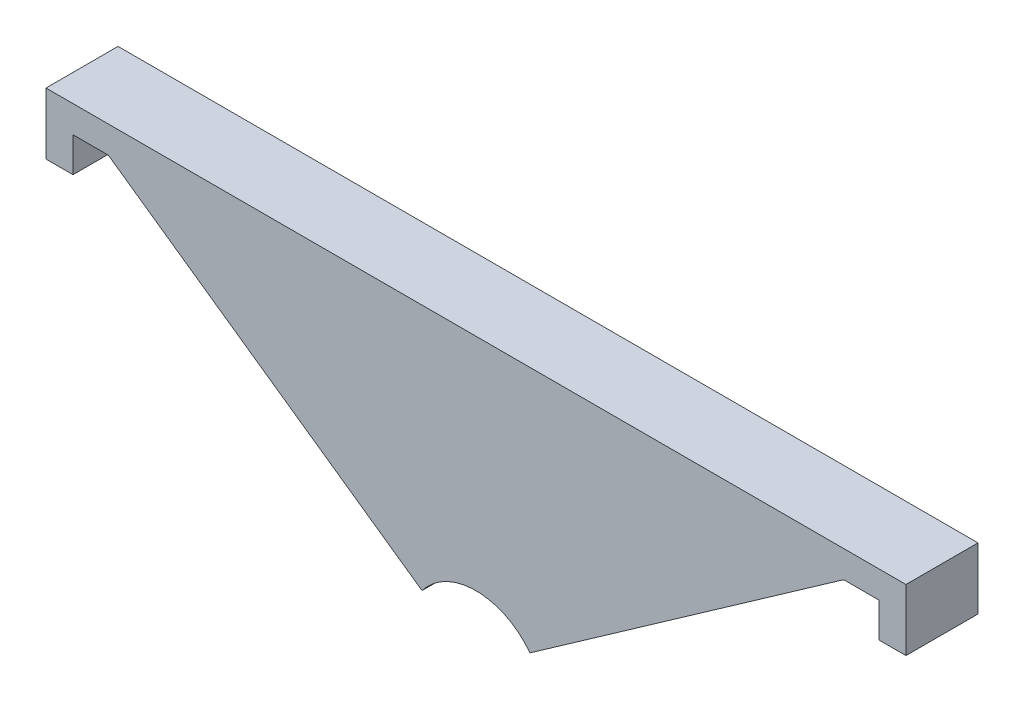
ISO-10303-21;
HEADER;
FILE_DESCRIPTION(('STEP AP214'),'2;1');
FILE_NAME('part.step','',(''),(''),'','','');
FILE_SCHEMA(('AUTOMOTIVE_DESIGN { 1 0 10303 214 1 1 1 1 }'));
ENDSEC;
DATA;
#1=APPLICATION_CONTEXT('core data for automotive mechanical design processes');
#2=APPLICATION_PROTOCOL_DEFINITION('international standard','automotive_design',2000,#1);
#3=PRODUCT_CONTEXT('',#1,'mechanical');
#4=PRODUCT('Part','Part','',(#3));
#5=PRODUCT_RELATED_PRODUCT_CATEGORY('part','',(#4));
#6=PRODUCT_DEFINITION_FORMATION('','',#4);
#7=PRODUCT_DEFINITION_CONTEXT('part definition',#1,'design');
#8=PRODUCT_DEFINITION('design','',#6,#7);
#9=PRODUCT_DEFINITION_SHAPE('','',#8);
#10=(LENGTH_UNIT() NAMED_UNIT(*) SI_UNIT(.MILLI.,.METRE.));
#11=(NAMED_UNIT(*) PLANE_ANGLE_UNIT() SI_UNIT($,.RADIAN.));
#12=(NAMED_UNIT(*) SI_UNIT($,.STERADIAN.) SOLID_ANGLE_UNIT());
#13=UNCERTAINTY_MEASURE_WITH_UNIT(LENGTH_MEASURE(1.E-05),#10,'distance_accuracy_value','');
#14=(GEOMETRIC_REPRESENTATION_CONTEXT(3) GLOBAL_UNCERTAINTY_ASSIGNED_CONTEXT((#13)) GLOBAL_UNIT_ASSIGNED_CONTEXT((#10,
#11,#12)) REPRESENTATION_CONTEXT('',''));
#15=CARTESIAN_POINT('',(0.,0.,0.));
#16=DIRECTION('',(0.,0.,1.));
#17=DIRECTION('',(1.,0.,0.));
#18=AXIS2_PLACEMENT_3D('',#15,#16,#17);
#19=CARTESIAN_POINT('',(-47.75,65.6296073544931,8.));
#20=DIRECTION('',(1.,0.,0.));
#21=DIRECTION('',(0.,0.,-1.));
#22=AXIS2_PLACEMENT_3D('',#19,#20,#21);
#23=PLANE('',#22);
#24=DIRECTION('',(0.,-1.,0.));
#25=VECTOR('',#24,1.);
#26=CARTESIAN_POINT('',(-47.75,65.6296073544931,0.));
#27=LINE('',#26,#25);
#28=CARTESIAN_POINT('',(-47.75,72.4689283735536,0.));
#29=VERTEX_POINT('',#28);
#30=CARTESIAN_POINT('',(-47.75,65.6296073544931,0.));
#31=VERTEX_POINT('',#30);
#32=EDGE_CURVE('E155',#29,#31,#27,.T.);
#33=ORIENTED_EDGE('',*,*,#32,.T.);
#34=DIRECTION('',(0.,0.,-1.));
#35=VECTOR('',#34,1.);
#36=CARTESIAN_POINT('',(-47.75,65.6296073544931,8.));
#37=LINE('',#36,#35);
#38=CARTESIAN_POINT('',(-47.75,65.6296073544931,8.));
#39=VERTEX_POINT('',#38);
#40=EDGE_CURVE('E11',#39,#31,#37,.T.);
#41=ORIENTED_EDGE('',*,*,#40,.F.);
#42=DIRECTION('',(0.,-1.,0.));
#43=VECTOR('',#42,1.);
#44=CARTESIAN_POINT('',(-47.75,65.6296073544931,8.));
#45=LINE('',#44,#43);
#46=CARTESIAN_POINT('',(-47.75,72.4689283735536,8.));
#47=VERTEX_POINT('',#46);
#48=EDGE_CURVE('E177',#47,#39,#45,.T.);
#49=ORIENTED_EDGE('',*,*,#48,.F.);
#50=DIRECTION('',(0.,0.,-1.));
#51=VECTOR('',#50,1.);
#52=CARTESIAN_POINT('',(-47.75,72.4689283735536,8.));
#53=LINE('',#52,#51);
#54=EDGE_CURVE('E151',#47,#29,#53,.T.);
#55=ORIENTED_EDGE('',*,*,#54,.T.);
#56=EDGE_LOOP('',(#33,#41,#49,#55));
#57=FACE_BOUND('',#56,.T.);
#58=ADVANCED_FACE('F35',(#57),#23,.F.);
#59=CARTESIAN_POINT('',(-47.75,65.6296073544931,8.));
#60=DIRECTION('',(0.,1.,0.));
#61=DIRECTION('',(0.,0.,1.));
#62=AXIS2_PLACEMENT_3D('',#59,#60,#61);
#63=PLANE('',#62);
#64=DIRECTION('',(1.,0.,0.));
#65=VECTOR('',#64,1.);
#66=CARTESIAN_POINT('',(-47.75,65.6296073544931,0.));
#67=LINE('',#66,#65);
#68=CARTESIAN_POINT('',(-44.75,65.6296073544931,0.));
#69=VERTEX_POINT('',#68);
#70=EDGE_CURVE('E158',#31,#69,#67,.T.);
#71=ORIENTED_EDGE('',*,*,#70,.T.);
#72=DIRECTION('',(0.,0.,-1.));
#73=VECTOR('',#72,1.);
#74=CARTESIAN_POINT('',(-44.75,65.6296073544931,8.));
#75=LINE('',#74,#73);
#76=CARTESIAN_POINT('',(-44.75,65.6296073544931,8.));
#77=VERTEX_POINT('',#76);
#78=EDGE_CURVE('E43',#77,#69,#75,.T.);
#79=ORIENTED_EDGE('',*,*,#78,.F.);
#80=DIRECTION('',(1.,0.,0.));
#81=VECTOR('',#80,1.);
#82=CARTESIAN_POINT('',(-47.75,65.6296073544931,8.));
#83=LINE('',#82,#81);
#84=EDGE_CURVE('E106',#39,#77,#83,.T.);
#85=ORIENTED_EDGE('',*,*,#84,.F.);
#86=ORIENTED_EDGE('',*,*,#40,.T.);
#87=EDGE_LOOP('',(#71,#79,#85,#86));
#88=FACE_BOUND('',#87,.T.);
#89=ADVANCED_FACE('F255',(#88),#63,.F.);
#90=CARTESIAN_POINT('',(-44.75,65.6296073544931,8.));
#91=DIRECTION('',(-1.,0.,0.));
#92=DIRECTION('',(0.,0.,1.));
#93=AXIS2_PLACEMENT_3D('',#90,#91,#92);
#94=PLANE('',#93);
#95=DIRECTION('',(0.,1.,0.));
#96=VECTOR('',#95,1.);
#97=CARTESIAN_POINT('',(-44.75,65.6296073544931,0.));
#98=LINE('',#97,#96);
#99=CARTESIAN_POINT('',(-44.75,69.4689283735536,0.));
#100=VERTEX_POINT('',#99);
#101=EDGE_CURVE('E160',#69,#100,#98,.T.);
#102=ORIENTED_EDGE('',*,*,#101,.T.);
#103=DIRECTION('',(0.,0.,-1.));
#104=VECTOR('',#103,1.);
#105=CARTESIAN_POINT('',(-44.75,69.4689283735536,8.));
#106=LINE('',#105,#104);
#107=CARTESIAN_POINT('',(-44.75,69.4689283735536,8.));
#108=VERTEX_POINT('',#107);
#109=EDGE_CURVE('E196',#108,#100,#106,.T.);
#110=ORIENTED_EDGE('',*,*,#109,.F.);
#111=DIRECTION('',(0.,1.,0.));
#112=VECTOR('',#111,1.);
#113=CARTESIAN_POINT('',(-44.75,65.6296073544931,8.));
#114=LINE('',#113,#112);
#115=EDGE_CURVE('E204',#77,#108,#114,.T.);
#116=ORIENTED_EDGE('',*,*,#115,.F.);
#117=ORIENTED_EDGE('',*,*,#78,.T.);
#118=EDGE_LOOP('',(#102,#110,#116,#117));
#119=FACE_BOUND('',#118,.T.);
#120=ADVANCED_FACE('F202',(#119),#94,.F.);
#121=CARTESIAN_POINT('',(-44.75,69.4689283735536,8.));
#122=DIRECTION('',(0.,1.,0.));
#123=DIRECTION('',(0.,0.,1.));
#124=AXIS2_PLACEMENT_3D('',#121,#122,#123);
#125=PLANE('',#124);
#126=DIRECTION('',(1.,0.,0.));
#127=VECTOR('',#126,1.);
#128=CARTESIAN_POINT('',(-44.75,69.4689283735536,0.));
#129=LINE('',#128,#127);
#130=CARTESIAN_POINT('',(-40.8316899293085,69.4689283735536,0.));
#131=VERTEX_POINT('',#130);
#132=EDGE_CURVE('E162',#100,#131,#129,.T.);
#133=ORIENTED_EDGE('',*,*,#132,.T.);
#134=DIRECTION('',(0.,0.,-1.));
#135=VECTOR('',#134,1.);
#136=CARTESIAN_POINT('',(-40.8316899293085,69.4689283735536,8.));
#137=LINE('',#136,#135);
#138=CARTESIAN_POINT('',(-40.8316899293085,69.4689283735536,8.));
#139=VERTEX_POINT('',#138);
#140=EDGE_CURVE('E193',#139,#131,#137,.T.);
#141=ORIENTED_EDGE('',*,*,#140,.F.);
#142=DIRECTION('',(1.,0.,0.));
#143=VECTOR('',#142,1.);
#144=CARTESIAN_POINT('',(-44.75,69.4689283735536,8.));
#145=LINE('',#144,#143);
#146=EDGE_CURVE('E222',#108,#139,#145,.T.);
#147=ORIENTED_EDGE('',*,*,#146,.F.);
#148=ORIENTED_EDGE('',*,*,#109,.T.);
#149=EDGE_LOOP('',(#133,#141,#147,#148));
#150=FACE_BOUND('',#149,.T.);
#151=ADVANCED_FACE('F213',(#150),#125,.F.);
#152=CARTESIAN_POINT('',(-40.8316899293085,69.4689283735536,8.));
#153=DIRECTION('',(0.574555500167891,0.818465623729442,0.));
#154=DIRECTION('',(-0.818465623729442,0.574555500167891,0.));
#155=AXIS2_PLACEMENT_3D('',#152,#153,#154);
#156=PLANE('',#155);
#157=DIRECTION('',(0.818465623729442,-0.574555500167891,0.));
#158=VECTOR('',#157,1.);
#159=CARTESIAN_POINT('',(-40.8316899293085,69.4689283735536,0.));
#160=LINE('',#159,#158);
#161=CARTESIAN_POINT('',(-5.99144208167181,45.0113880105764,0.));
#162=VERTEX_POINT('',#161);
#163=EDGE_CURVE('E164',#131,#162,#160,.T.);
#164=ORIENTED_EDGE('',*,*,#163,.T.);
#165=DIRECTION('',(0.,0.,-1.));
#166=VECTOR('',#165,1.);
#167=CARTESIAN_POINT('',(-5.99144208167181,45.0113880105764,8.));
#168=LINE('',#167,#166);
#169=CARTESIAN_POINT('',(-5.99144208167181,45.0113880105764,8.));
#170=VERTEX_POINT('',#169);
#171=EDGE_CURVE('E190',#170,#162,#168,.T.);
#172=ORIENTED_EDGE('',*,*,#171,.F.);
#173=DIRECTION('',(0.818465623729442,-0.574555500167891,0.));
#174=VECTOR('',#173,1.);
#175=CARTESIAN_POINT('',(-40.8316899293085,69.4689283735536,8.));
#176=LINE('',#175,#174);
#177=EDGE_CURVE('E219',#139,#170,#176,.T.);
#178=ORIENTED_EDGE('',*,*,#177,.F.);
#179=ORIENTED_EDGE('',*,*,#140,.T.);
#180=EDGE_LOOP('',(#164,#172,#178,#179));
#181=FACE_BOUND('',#180,.T.);
#182=ADVANCED_FACE('F217',(#181),#156,.F.);
#183=CARTESIAN_POINT('',(0.,40.5,8.));
#184=DIRECTION('',(0.,0.,-1.));
#185=DIRECTION('',(-1.,0.,0.));
#186=AXIS2_PLACEMENT_3D('',#183,#184,#185);
#187=CYLINDRICAL_SURFACE('',#186,7.5);
#188=CARTESIAN_POINT('',(0.,40.5,0.));
#189=DIRECTION('',(0.,0.,-1.));
#190=DIRECTION('',(1.,0.,0.));
#191=AXIS2_PLACEMENT_3D('',#188,#189,#190);
#192=CIRCLE('',#191,7.5);
#193=CARTESIAN_POINT('',(5.99144208167181,45.0113880105764,0.));
#194=VERTEX_POINT('',#193);
#195=EDGE_CURVE('E166',#162,#194,#192,.T.);
#196=ORIENTED_EDGE('',*,*,#195,.T.);
#197=DIRECTION('',(0.,0.,-1.));
#198=VECTOR('',#197,1.);
#199=CARTESIAN_POINT('',(5.99144208167181,45.0113880105764,8.));
#200=LINE('',#199,#198);
#201=CARTESIAN_POINT('',(5.99144208167181,45.0113880105764,8.));
#202=VERTEX_POINT('',#201);
#203=EDGE_CURVE('E187',#202,#194,#200,.T.);
#204=ORIENTED_EDGE('',*,*,#203,.F.);
#205=CARTESIAN_POINT('',(0.,40.5,8.));
#206=DIRECTION('',(0.,0.,-1.));
#207=DIRECTION('',(1.,0.,0.));
#208=AXIS2_PLACEMENT_3D('',#205,#206,#207);
#209=CIRCLE('',#208,7.5);
#210=EDGE_CURVE('E221',#170,#202,#209,.T.);
#211=ORIENTED_EDGE('',*,*,#210,.F.);
#212=ORIENTED_EDGE('',*,*,#171,.T.);
#213=EDGE_LOOP('',(#196,#204,#211,#212));
#214=FACE_BOUND('',#213,.T.);
#215=ADVANCED_FACE('F268',(#214),#187,.F.);
#216=CARTESIAN_POINT('',(40.8316899293085,69.4689283735536,8.));
#217=DIRECTION('',(-0.574555500167891,0.818465623729442,0.));
#218=DIRECTION('',(-0.818465623729442,-0.574555500167891,0.));
#219=AXIS2_PLACEMENT_3D('',#216,#217,#218);
#220=PLANE('',#219);
#221=DIRECTION('',(0.818465623729442,0.574555500167891,0.));
#222=VECTOR('',#221,1.);
#223=CARTESIAN_POINT('',(40.8316899293085,69.4689283735536,0.));
#224=LINE('',#223,#222);
#225=CARTESIAN_POINT('',(40.8316899293085,69.4689283735536,0.));
#226=VERTEX_POINT('',#225);
#227=EDGE_CURVE('E168',#194,#226,#224,.T.);
#228=ORIENTED_EDGE('',*,*,#227,.T.);
#229=DIRECTION('',(0.,0.,-1.));
#230=VECTOR('',#229,1.);
#231=CARTESIAN_POINT('',(40.8316899293085,69.4689283735536,8.));
#232=LINE('',#231,#230);
#233=CARTESIAN_POINT('',(40.8316899293085,69.4689283735536,8.));
#234=VERTEX_POINT('',#233);
#235=EDGE_CURVE('E184',#234,#226,#232,.T.);
#236=ORIENTED_EDGE('',*,*,#235,.F.);
#237=DIRECTION('',(0.818465623729442,0.574555500167891,0.));
#238=VECTOR('',#237,1.);
#239=CARTESIAN_POINT('',(40.8316899293085,69.4689283735536,8.));
#240=LINE('',#239,#238);
#241=EDGE_CURVE('E224',#202,#234,#240,.T.);
#242=ORIENTED_EDGE('',*,*,#241,.F.);
#243=ORIENTED_EDGE('',*,*,#203,.T.);
#244=EDGE_LOOP('',(#228,#236,#242,#243));
#245=FACE_BOUND('',#244,.T.);
#246=ADVANCED_FACE('F271',(#245),#220,.F.);
#247=CARTESIAN_POINT('',(44.75,69.4689283735536,8.));
#248=DIRECTION('',(0.,1.,0.));
#249=DIRECTION('',(0.,0.,1.));
#250=AXIS2_PLACEMENT_3D('',#247,#248,#249);
#251=PLANE('',#250);
#252=DIRECTION('',(1.,0.,0.));
#253=VECTOR('',#252,1.);
#254=CARTESIAN_POINT('',(44.75,69.4689283735536,0.));
#255=LINE('',#254,#253);
#256=CARTESIAN_POINT('',(44.75,69.4689283735536,0.));
#257=VERTEX_POINT('',#256);
#258=EDGE_CURVE('E170',#226,#257,#255,.T.);
#259=ORIENTED_EDGE('',*,*,#258,.T.);
#260=DIRECTION('',(0.,0.,-1.));
#261=VECTOR('',#260,1.);
#262=CARTESIAN_POINT('',(44.75,69.4689283735536,8.));
#263=LINE('',#262,#261);
#264=CARTESIAN_POINT('',(44.75,69.4689283735536,8.));
#265=VERTEX_POINT('',#264);
#266=EDGE_CURVE('E181',#265,#257,#263,.T.);
#267=ORIENTED_EDGE('',*,*,#266,.F.);
#268=DIRECTION('',(1.,0.,0.));
#269=VECTOR('',#268,1.);
#270=CARTESIAN_POINT('',(44.75,69.4689283735536,8.));
#271=LINE('',#270,#269);
#272=EDGE_CURVE('E230',#234,#265,#271,.T.);
#273=ORIENTED_EDGE('',*,*,#272,.F.);
#274=ORIENTED_EDGE('',*,*,#235,.T.);
#275=EDGE_LOOP('',(#259,#267,#273,#274));
#276=FACE_BOUND('',#275,.T.);
#277=ADVANCED_FACE('F236',(#276),#251,.F.);
#278=CARTESIAN_POINT('',(44.75,65.6296073544931,8.));
#279=DIRECTION('',(1.,0.,0.));
#280=DIRECTION('',(0.,0.,-1.));
#281=AXIS2_PLACEMENT_3D('',#278,#279,#280);
#282=PLANE('',#281);
#283=DIRECTION('',(0.,-1.,0.));
#284=VECTOR('',#283,1.);
#285=CARTESIAN_POINT('',(44.75,65.6296073544931,0.));
#286=LINE('',#285,#284);
#287=CARTESIAN_POINT('',(44.75,65.6296073544931,0.));
#288=VERTEX_POINT('',#287);
#289=EDGE_CURVE('E172',#257,#288,#286,.T.);
#290=ORIENTED_EDGE('',*,*,#289,.T.);
#291=DIRECTION('',(0.,0.,-1.));
#292=VECTOR('',#291,1.);
#293=CARTESIAN_POINT('',(44.75,65.6296073544931,8.));
#294=LINE('',#293,#292);
#295=CARTESIAN_POINT('',(44.75,65.6296073544931,8.));
#296=VERTEX_POINT('',#295);
#297=EDGE_CURVE('E146',#296,#288,#294,.T.);
#298=ORIENTED_EDGE('',*,*,#297,.F.);
#299=DIRECTION('',(0.,-1.,0.));
#300=VECTOR('',#299,1.);
#301=CARTESIAN_POINT('',(44.75,65.6296073544931,8.));
#302=LINE('',#301,#300);
#303=EDGE_CURVE('E137',#265,#296,#302,.T.);
#304=ORIENTED_EDGE('',*,*,#303,.F.);
#305=ORIENTED_EDGE('',*,*,#266,.T.);
#306=EDGE_LOOP('',(#290,#298,#304,#305));
#307=FACE_BOUND('',#306,.T.);
#308=ADVANCED_FACE('F240',(#307),#282,.F.);
#309=CARTESIAN_POINT('',(47.75,65.6296073544931,8.));
#310=DIRECTION('',(0.,1.,0.));
#311=DIRECTION('',(0.,0.,1.));
#312=AXIS2_PLACEMENT_3D('',#309,#310,#311);
#313=PLANE('',#312);
#314=DIRECTION('',(1.,0.,0.));
#315=VECTOR('',#314,1.);
#316=CARTESIAN_POINT('',(47.75,65.6296073544931,0.));
#317=LINE('',#316,#315);
#318=CARTESIAN_POINT('',(47.75,65.6296073544931,0.));
#319=VERTEX_POINT('',#318);
#320=EDGE_CURVE('E145',#288,#319,#317,.T.);
#321=ORIENTED_EDGE('',*,*,#320,.T.);
#322=DIRECTION('',(0.,0.,-1.));
#323=VECTOR('',#322,1.);
#324=CARTESIAN_POINT('',(47.75,65.6296073544931,8.));
#325=LINE('',#324,#323);
#326=CARTESIAN_POINT('',(47.75,65.6296073544931,8.));
#327=VERTEX_POINT('',#326);
#328=EDGE_CURVE('E142',#327,#319,#325,.T.);
#329=ORIENTED_EDGE('',*,*,#328,.F.);
#330=DIRECTION('',(1.,0.,0.));
#331=VECTOR('',#330,1.);
#332=CARTESIAN_POINT('',(47.75,65.6296073544931,8.));
#333=LINE('',#332,#331);
#334=EDGE_CURVE('E131',#296,#327,#333,.T.);
#335=ORIENTED_EDGE('',*,*,#334,.F.);
#336=ORIENTED_EDGE('',*,*,#297,.T.);
#337=EDGE_LOOP('',(#321,#329,#335,#336));
#338=FACE_BOUND('',#337,.T.);
#339=ADVANCED_FACE('F143',(#338),#313,.F.);
#340=CARTESIAN_POINT('',(47.75,65.6296073544931,8.));
#341=DIRECTION('',(-1.,0.,0.));
#342=DIRECTION('',(0.,0.,1.));
#343=AXIS2_PLACEMENT_3D('',#340,#341,#342);
#344=PLANE('',#343);
#345=DIRECTION('',(0.,1.,0.));
#346=VECTOR('',#345,1.);
#347=CARTESIAN_POINT('',(47.75,65.6296073544931,0.));
#348=LINE('',#347,#346);
#349=CARTESIAN_POINT('',(47.75,72.4689283735536,0.));
#350=VERTEX_POINT('',#349);
#351=EDGE_CURVE('E92',#319,#350,#348,.T.);
#352=ORIENTED_EDGE('',*,*,#351,.T.);
#353=DIRECTION('',(0.,0.,-1.));
#354=VECTOR('',#353,1.);
#355=CARTESIAN_POINT('',(47.75,72.4689283735536,8.));
#356=LINE('',#355,#354);
#357=CARTESIAN_POINT('',(47.75,72.4689283735536,8.));
#358=VERTEX_POINT('',#357);
#359=EDGE_CURVE('E147',#358,#350,#356,.T.);
#360=ORIENTED_EDGE('',*,*,#359,.F.);
#361=DIRECTION('',(0.,1.,0.));
#362=VECTOR('',#361,1.);
#363=CARTESIAN_POINT('',(47.75,65.6296073544931,8.));
#364=LINE('',#363,#362);
#365=EDGE_CURVE('E135',#327,#358,#364,.T.);
#366=ORIENTED_EDGE('',*,*,#365,.F.);
#367=ORIENTED_EDGE('',*,*,#328,.T.);
#368=EDGE_LOOP('',(#352,#360,#366,#367));
#369=FACE_BOUND('',#368,.T.);
#370=ADVANCED_FACE('F149',(#369),#344,.F.);
#371=CARTESIAN_POINT('',(47.75,72.4689283735536,8.));
#372=DIRECTION('',(0.,-1.,0.));
#373=DIRECTION('',(0.,0.,-1.));
#374=AXIS2_PLACEMENT_3D('',#371,#372,#373);
#375=PLANE('',#374);
#376=DIRECTION('',(-1.,0.,0.));
#377=VECTOR('',#376,1.);
#378=CARTESIAN_POINT('',(47.75,72.4689283735536,0.));
#379=LINE('',#378,#377);
#380=EDGE_CURVE('E98',#350,#29,#379,.T.);
#381=ORIENTED_EDGE('',*,*,#380,.T.);
#382=ORIENTED_EDGE('',*,*,#54,.F.);
#383=DIRECTION('',(-1.,0.,0.));
#384=VECTOR('',#383,1.);
#385=CARTESIAN_POINT('',(47.75,72.4689283735536,8.));
#386=LINE('',#385,#384);
#387=EDGE_CURVE('E51',#358,#47,#386,.T.);
#388=ORIENTED_EDGE('',*,*,#387,.F.);
#389=ORIENTED_EDGE('',*,*,#359,.T.);
#390=EDGE_LOOP('',(#381,#382,#388,#389));
#391=FACE_BOUND('',#390,.T.);
#392=ADVANCED_FACE('F244',(#391),#375,.F.);
#393=CARTESIAN_POINT('',(0.,40.5,8.));
#394=DIRECTION('',(0.,0.,1.));
#395=DIRECTION('',(1.,0.,0.));
#396=AXIS2_PLACEMENT_3D('',#393,#394,#395);
#397=PLANE('',#396);
#398=ORIENTED_EDGE('',*,*,#48,.T.);
#399=ORIENTED_EDGE('',*,*,#84,.T.);
#400=ORIENTED_EDGE('',*,*,#115,.T.);
#401=ORIENTED_EDGE('',*,*,#146,.T.);
#402=ORIENTED_EDGE('',*,*,#177,.T.);
#403=ORIENTED_EDGE('',*,*,#210,.T.);
#404=ORIENTED_EDGE('',*,*,#241,.T.);
#405=ORIENTED_EDGE('',*,*,#272,.T.);
#406=ORIENTED_EDGE('',*,*,#303,.T.);
#407=ORIENTED_EDGE('',*,*,#334,.T.);
#408=ORIENTED_EDGE('',*,*,#365,.T.);
#409=ORIENTED_EDGE('',*,*,#387,.T.);
#410=EDGE_LOOP('',(#398,#399,#400,#401,#402,#403,#404,#405,#406,#407,#408,#409));
#411=FACE_BOUND('',#410,.T.);
#412=ADVANCED_FACE('F133',(#411),#397,.T.);
#413=CARTESIAN_POINT('',(0.,40.5,0.));
#414=DIRECTION('',(0.,0.,1.));
#415=DIRECTION('',(1.,0.,0.));
#416=AXIS2_PLACEMENT_3D('',#413,#414,#415);
#417=PLANE('',#416);
#418=ORIENTED_EDGE('',*,*,#32,.F.);
#419=ORIENTED_EDGE('',*,*,#380,.F.);
#420=ORIENTED_EDGE('',*,*,#351,.F.);
#421=ORIENTED_EDGE('',*,*,#320,.F.);
#422=ORIENTED_EDGE('',*,*,#289,.F.);
#423=ORIENTED_EDGE('',*,*,#258,.F.);
#424=ORIENTED_EDGE('',*,*,#227,.F.);
#425=ORIENTED_EDGE('',*,*,#195,.F.);
#426=ORIENTED_EDGE('',*,*,#163,.F.);
#427=ORIENTED_EDGE('',*,*,#132,.F.);
#428=ORIENTED_EDGE('',*,*,#101,.F.);
#429=ORIENTED_EDGE('',*,*,#70,.F.);
#430=EDGE_LOOP('',(#418,#419,#420,#421,#422,#423,#424,#425,#426,#427,#428,#429));
#431=FACE_BOUND('',#430,.T.);
#432=ADVANCED_FACE('F208',(#431),#417,.F.);
#433=CLOSED_SHELL('',(#58,#89,#120,#151,#182,#215,#246,#277,#308,#339,#370,#392,#412,#432));
#434=MANIFOLD_SOLID_BREP('B2',#433);
#435=ADVANCED_BREP_SHAPE_REPRESENTATION('',(#18,#434),#14);
#436=SHAPE_DEFINITION_REPRESENTATION(#9,#435);
ENDSEC;
END-ISO-10303-21;
